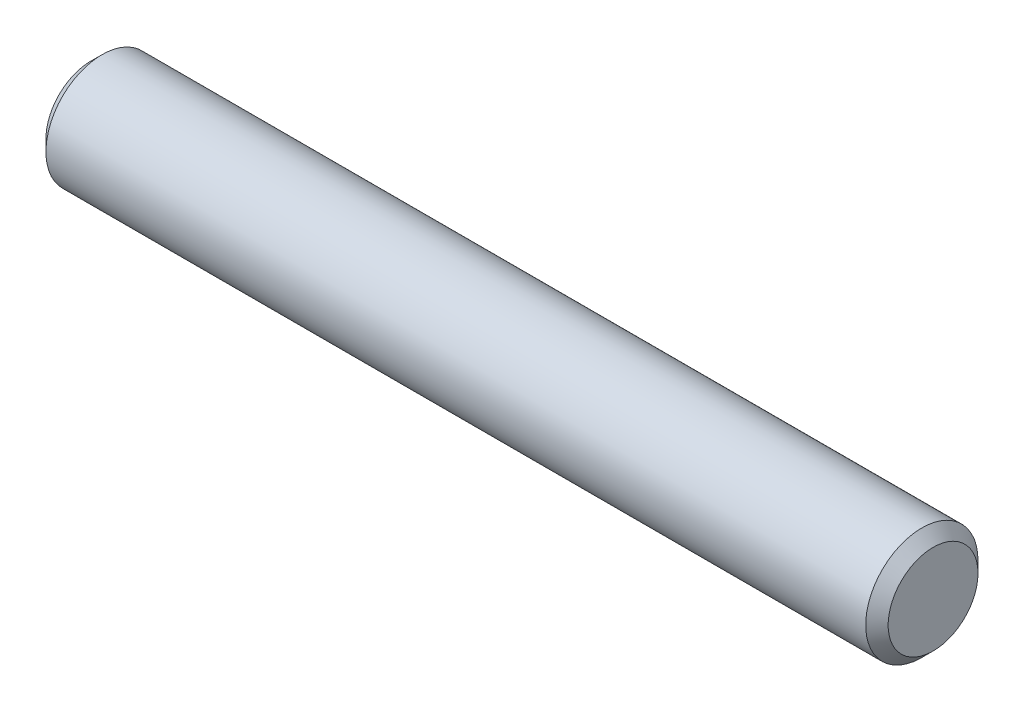
ISO-10303-21;
HEADER;
FILE_DESCRIPTION(('STEP AP214'),'2;1');
FILE_NAME('part.step','',(''),(''),'','','');
FILE_SCHEMA(('AUTOMOTIVE_DESIGN { 1 0 10303 214 1 1 1 1 }'));
ENDSEC;
DATA;
#1=APPLICATION_CONTEXT('core data for automotive mechanical design processes');
#2=APPLICATION_PROTOCOL_DEFINITION('international standard','automotive_design',2000,#1);
#3=PRODUCT_CONTEXT('',#1,'mechanical');
#4=PRODUCT('Part','Part','',(#3));
#5=PRODUCT_RELATED_PRODUCT_CATEGORY('part','',(#4));
#6=PRODUCT_DEFINITION_FORMATION('','',#4);
#7=PRODUCT_DEFINITION_CONTEXT('part definition',#1,'design');
#8=PRODUCT_DEFINITION('design','',#6,#7);
#9=PRODUCT_DEFINITION_SHAPE('','',#8);
#10=(LENGTH_UNIT() NAMED_UNIT(*) SI_UNIT(.MILLI.,.METRE.));
#11=(NAMED_UNIT(*) PLANE_ANGLE_UNIT() SI_UNIT($,.RADIAN.));
#12=(NAMED_UNIT(*) SI_UNIT($,.STERADIAN.) SOLID_ANGLE_UNIT());
#13=UNCERTAINTY_MEASURE_WITH_UNIT(LENGTH_MEASURE(1.E-05),#10,'distance_accuracy_value','');
#14=(GEOMETRIC_REPRESENTATION_CONTEXT(3) GLOBAL_UNCERTAINTY_ASSIGNED_CONTEXT((#13)) GLOBAL_UNIT_ASSIGNED_CONTEXT((#10,
#11,#12)) REPRESENTATION_CONTEXT('',''));
#15=CARTESIAN_POINT('',(0.,0.,0.));
#16=DIRECTION('',(0.,0.,1.));
#17=DIRECTION('',(1.,0.,0.));
#18=AXIS2_PLACEMENT_3D('',#15,#16,#17);
#19=CARTESIAN_POINT('',(-23.8125,0.,0.));
#20=DIRECTION('',(1.,0.,0.));
#21=DIRECTION('',(0.,0.,-1.));
#22=AXIS2_PLACEMENT_3D('',#19,#20,#21);
#23=CYLINDRICAL_SURFACE('',#22,3.175);
#24=CARTESIAN_POINT('',(23.1775,0.,0.));
#25=DIRECTION('',(1.,0.,0.));
#26=DIRECTION('',(0.,0.,-1.));
#27=AXIS2_PLACEMENT_3D('',#24,#25,#26);
#28=CIRCLE('',#27,3.175);
#29=CARTESIAN_POINT('',(23.1775,0.,-3.175));
#30=VERTEX_POINT('',#29);
#31=EDGE_CURVE('E37',#30,#30,#28,.F.);
#32=ORIENTED_EDGE('',*,*,#31,.T.);
#33=EDGE_LOOP('',(#32));
#34=FACE_BOUND('',#33,.T.);
#35=CARTESIAN_POINT('',(-23.1775,0.,0.));
#36=DIRECTION('',(1.,0.,0.));
#37=DIRECTION('',(0.,0.,-1.));
#38=AXIS2_PLACEMENT_3D('',#35,#36,#37);
#39=CIRCLE('',#38,3.175);
#40=CARTESIAN_POINT('',(-23.1775,0.,-3.175));
#41=VERTEX_POINT('',#40);
#42=EDGE_CURVE('E41',#41,#41,#39,.T.);
#43=ORIENTED_EDGE('',*,*,#42,.T.);
#44=EDGE_LOOP('',(#43));
#45=FACE_BOUND('',#44,.T.);
#46=ADVANCED_FACE('F30',(#34,#45),#23,.T.);
#47=CARTESIAN_POINT('',(-23.8125,0.,0.));
#48=DIRECTION('',(1.,0.,0.));
#49=DIRECTION('',(0.,0.,-1.));
#50=AXIS2_PLACEMENT_3D('',#47,#48,#49);
#51=PLANE('',#50);
#52=CARTESIAN_POINT('',(-23.8125,0.,0.));
#53=DIRECTION('',(1.,0.,0.));
#54=DIRECTION('',(0.,0.,-1.));
#55=AXIS2_PLACEMENT_3D('',#52,#53,#54);
#56=CIRCLE('',#55,2.54);
#57=CARTESIAN_POINT('',(-23.8125,0.,-2.54));
#58=VERTEX_POINT('',#57);
#59=EDGE_CURVE('E10',#58,#58,#56,.F.);
#60=ORIENTED_EDGE('',*,*,#59,.T.);
#61=EDGE_LOOP('',(#60));
#62=FACE_BOUND('',#61,.T.);
#63=ADVANCED_FACE('F61',(#62),#51,.F.);
#64=CARTESIAN_POINT('',(23.8125,0.,0.));
#65=DIRECTION('',(1.,0.,0.));
#66=DIRECTION('',(0.,0.,-1.));
#67=AXIS2_PLACEMENT_3D('',#64,#65,#66);
#68=PLANE('',#67);
#69=CARTESIAN_POINT('',(23.8125,0.,0.));
#70=DIRECTION('',(1.,0.,0.));
#71=DIRECTION('',(0.,0.,-1.));
#72=AXIS2_PLACEMENT_3D('',#69,#70,#71);
#73=CIRCLE('',#72,2.53999999999999);
#74=CARTESIAN_POINT('',(23.8125,0.,-2.53999999999999));
#75=VERTEX_POINT('',#74);
#76=EDGE_CURVE('E45',#75,#75,#73,.T.);
#77=ORIENTED_EDGE('',*,*,#76,.T.);
#78=EDGE_LOOP('',(#77));
#79=FACE_BOUND('',#78,.T.);
#80=ADVANCED_FACE('F51',(#79),#68,.T.);
#81=CARTESIAN_POINT('',(23.8125,0.,0.));
#82=DIRECTION('',(-1.,0.,0.));
#83=DIRECTION('',(0.,0.,1.));
#84=AXIS2_PLACEMENT_3D('',#81,#82,#83);
#85=CONICAL_SURFACE('',#84,2.53999999999999,0.785398163397445);
#86=ORIENTED_EDGE('',*,*,#31,.F.);
#87=EDGE_LOOP('',(#86));
#88=FACE_BOUND('',#87,.T.);
#89=ORIENTED_EDGE('',*,*,#76,.F.);
#90=EDGE_LOOP('',(#89));
#91=FACE_BOUND('',#90,.T.);
#92=ADVANCED_FACE('F53',(#88,#91),#85,.T.);
#93=CARTESIAN_POINT('',(-23.1775,0.,0.));
#94=DIRECTION('',(1.,0.,0.));
#95=DIRECTION('',(0.,0.,-1.));
#96=AXIS2_PLACEMENT_3D('',#93,#94,#95);
#97=CONICAL_SURFACE('',#96,3.175,0.785398163397456);
#98=ORIENTED_EDGE('',*,*,#59,.F.);
#99=EDGE_LOOP('',(#98));
#100=FACE_BOUND('',#99,.T.);
#101=ORIENTED_EDGE('',*,*,#42,.F.);
#102=EDGE_LOOP('',(#101));
#103=FACE_BOUND('',#102,.T.);
#104=ADVANCED_FACE('F32',(#100,#103),#97,.T.);
#105=CLOSED_SHELL('',(#46,#63,#80,#92,#104));
#106=MANIFOLD_SOLID_BREP('B2',#105);
#107=ADVANCED_BREP_SHAPE_REPRESENTATION('',(#18,#106),#14);
#108=SHAPE_DEFINITION_REPRESENTATION(#9,#107);
ENDSEC;
END-ISO-10303-21;
